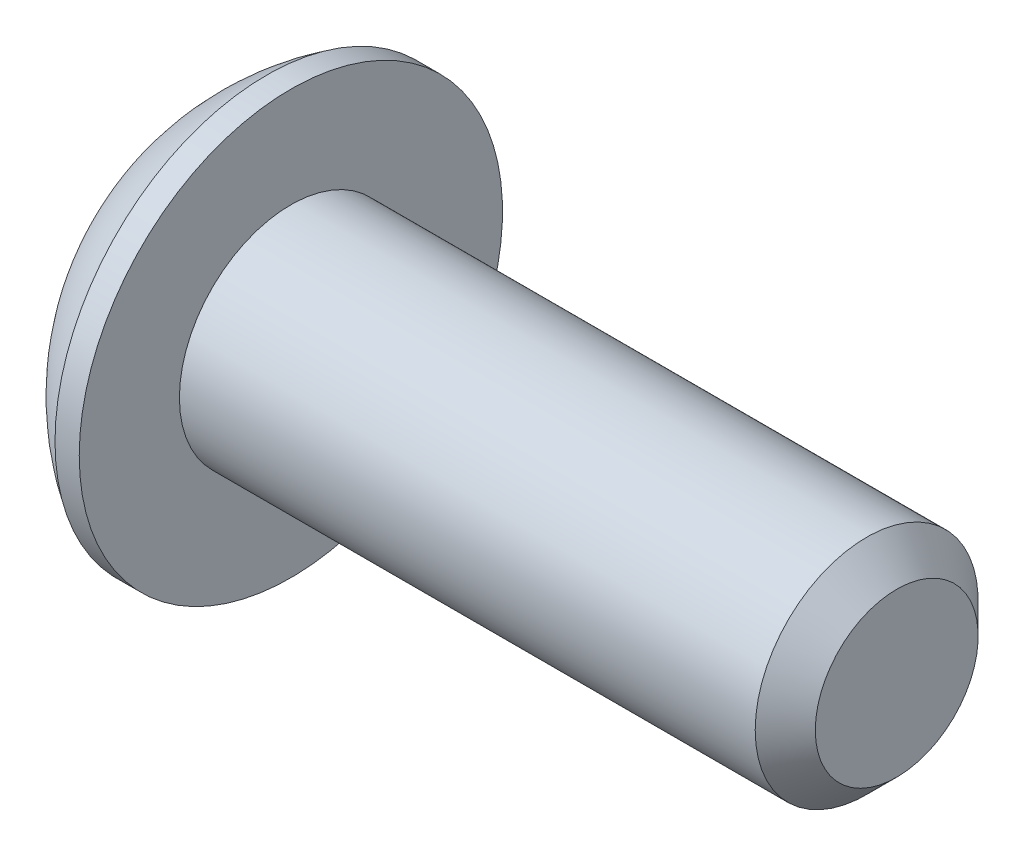
ISO-10303-21;
HEADER;
FILE_DESCRIPTION(('STEP AP214'),'2;1');
FILE_NAME('part.step','',(''),(''),'','','');
FILE_SCHEMA(('AUTOMOTIVE_DESIGN { 1 0 10303 214 1 1 1 1 }'));
ENDSEC;
DATA;
#1=APPLICATION_CONTEXT('core data for automotive mechanical design processes');
#2=APPLICATION_PROTOCOL_DEFINITION('international standard','automotive_design',2000,#1);
#3=PRODUCT_CONTEXT('',#1,'mechanical');
#4=PRODUCT('Part','Part','',(#3));
#5=PRODUCT_RELATED_PRODUCT_CATEGORY('part','',(#4));
#6=PRODUCT_DEFINITION_FORMATION('','',#4);
#7=PRODUCT_DEFINITION_CONTEXT('part definition',#1,'design');
#8=PRODUCT_DEFINITION('design','',#6,#7);
#9=PRODUCT_DEFINITION_SHAPE('','',#8);
#10=(LENGTH_UNIT() NAMED_UNIT(*) SI_UNIT(.MILLI.,.METRE.));
#11=(NAMED_UNIT(*) PLANE_ANGLE_UNIT() SI_UNIT($,.RADIAN.));
#12=(NAMED_UNIT(*) SI_UNIT($,.STERADIAN.) SOLID_ANGLE_UNIT());
#13=UNCERTAINTY_MEASURE_WITH_UNIT(LENGTH_MEASURE(1.E-05),#10,'distance_accuracy_value','');
#14=(GEOMETRIC_REPRESENTATION_CONTEXT(3) GLOBAL_UNCERTAINTY_ASSIGNED_CONTEXT((#13)) GLOBAL_UNIT_ASSIGNED_CONTEXT((#10,
#11,#12)) REPRESENTATION_CONTEXT('',''));
#15=CARTESIAN_POINT('',(0.,0.,0.));
#16=DIRECTION('',(0.,0.,1.));
#17=DIRECTION('',(1.,0.,0.));
#18=AXIS2_PLACEMENT_3D('',#15,#16,#17);
#19=CARTESIAN_POINT('',(0.,0.,0.));
#20=DIRECTION('',(-1.,0.,0.));
#21=DIRECTION('',(0.,0.,1.));
#22=AXIS2_PLACEMENT_3D('',#19,#20,#21);
#23=PLANE('',#22);
#24=CARTESIAN_POINT('',(0.,0.,0.));
#25=DIRECTION('',(-1.,0.,0.));
#26=DIRECTION('',(0.,0.,1.));
#27=AXIS2_PLACEMENT_3D('',#24,#25,#26);
#28=CIRCLE('',#27,1.6637);
#29=CARTESIAN_POINT('',(0.,0.,1.6637));
#30=VERTEX_POINT('',#29);
#31=EDGE_CURVE('E11',#30,#30,#28,.T.);
#32=ORIENTED_EDGE('',*,*,#31,.T.);
#33=EDGE_LOOP('',(#32));
#34=FACE_BOUND('',#33,.T.);
#35=DIRECTION('',(0.,-1.,0.));
#36=VECTOR('',#35,1.);
#37=CARTESIAN_POINT('',(0.,-0.571923176659243,0.9906));
#38=LINE('',#37,#36);
#39=CARTESIAN_POINT('',(0.,0.571923176659244,0.990600000000001));
#40=VERTEX_POINT('',#39);
#41=CARTESIAN_POINT('',(0.,-0.571923176659243,0.9906));
#42=VERTEX_POINT('',#41);
#43=EDGE_CURVE('E46',#40,#42,#38,.T.);
#44=ORIENTED_EDGE('',*,*,#43,.T.);
#45=DIRECTION('',(0.,-0.499999999999999,-0.866025403784439));
#46=VECTOR('',#45,1.);
#47=CARTESIAN_POINT('',(0.,-1.14384635331848,0.));
#48=LINE('',#47,#46);
#49=CARTESIAN_POINT('',(0.,-1.14384635331848,0.));
#50=VERTEX_POINT('',#49);
#51=EDGE_CURVE('E364',#42,#50,#48,.T.);
#52=ORIENTED_EDGE('',*,*,#51,.T.);
#53=DIRECTION('',(0.,0.499999999999999,-0.866025403784439));
#54=VECTOR('',#53,1.);
#55=CARTESIAN_POINT('',(0.,-0.571923176659242,-0.9906));
#56=LINE('',#55,#54);
#57=CARTESIAN_POINT('',(0.,-0.571923176659242,-0.9906));
#58=VERTEX_POINT('',#57);
#59=EDGE_CURVE('E126',#50,#58,#56,.T.);
#60=ORIENTED_EDGE('',*,*,#59,.T.);
#61=DIRECTION('',(0.,1.,0.));
#62=VECTOR('',#61,1.);
#63=CARTESIAN_POINT('',(0.,0.571923176659244,-0.9906));
#64=LINE('',#63,#62);
#65=CARTESIAN_POINT('',(0.,0.571923176659244,-0.9906));
#66=VERTEX_POINT('',#65);
#67=EDGE_CURVE('E367',#58,#66,#64,.T.);
#68=ORIENTED_EDGE('',*,*,#67,.T.);
#69=DIRECTION('',(0.,0.5,0.866025403784439));
#70=VECTOR('',#69,1.);
#71=CARTESIAN_POINT('',(0.,1.14384635331849,0.));
#72=LINE('',#71,#70);
#73=CARTESIAN_POINT('',(0.,1.14384635331849,0.));
#74=VERTEX_POINT('',#73);
#75=EDGE_CURVE('E369',#66,#74,#72,.T.);
#76=ORIENTED_EDGE('',*,*,#75,.T.);
#77=DIRECTION('',(0.,-0.5,0.866025403784439));
#78=VECTOR('',#77,1.);
#79=CARTESIAN_POINT('',(0.,0.571923176659244,0.990600000000001));
#80=LINE('',#79,#78);
#81=EDGE_CURVE('E371',#74,#40,#80,.T.);
#82=ORIENTED_EDGE('',*,*,#81,.T.);
#83=EDGE_LOOP('',(#44,#52,#60,#68,#76,#82));
#84=FACE_BOUND('',#83,.T.);
#85=ADVANCED_FACE('F32',(#34,#84),#23,.T.);
#86=CARTESIAN_POINT('',(3.55485043103449,0.,0.));
#87=DIRECTION('',(-1.,0.,0.));
#88=DIRECTION('',(0.,1.,0.));
#89=AXIS2_PLACEMENT_3D('',#86,#87,#88);
#90=SPHERICAL_SURFACE('',#89,3.92490245446);
#91=CARTESIAN_POINT('',(1.4732,0.,0.));
#92=DIRECTION('',(-1.,0.,0.));
#93=DIRECTION('',(0.,0.,1.));
#94=AXIS2_PLACEMENT_3D('',#91,#92,#93);
#95=CIRCLE('',#94,3.3274);
#96=CARTESIAN_POINT('',(1.4732,0.,3.3274));
#97=VERTEX_POINT('',#96);
#98=EDGE_CURVE('E39',#97,#97,#95,.T.);
#99=ORIENTED_EDGE('',*,*,#98,.T.);
#100=EDGE_LOOP('',(#99));
#101=FACE_BOUND('',#100,.T.);
#102=ORIENTED_EDGE('',*,*,#31,.F.);
#103=EDGE_LOOP('',(#102));
#104=FACE_BOUND('',#103,.T.);
#105=ADVANCED_FACE('F153',(#101,#104),#90,.T.);
#106=CARTESIAN_POINT('',(0.,0.,0.));
#107=DIRECTION('',(-1.,0.,0.));
#108=DIRECTION('',(0.,0.,1.));
#109=AXIS2_PLACEMENT_3D('',#106,#107,#108);
#110=CYLINDRICAL_SURFACE('',#109,3.3274);
#111=ORIENTED_EDGE('',*,*,#98,.F.);
#112=EDGE_LOOP('',(#111));
#113=FACE_BOUND('',#112,.T.);
#114=CARTESIAN_POINT('',(1.8542,0.,0.));
#115=DIRECTION('',(-1.,0.,0.));
#116=DIRECTION('',(0.,0.,1.));
#117=AXIS2_PLACEMENT_3D('',#114,#115,#116);
#118=CIRCLE('',#117,3.3274);
#119=CARTESIAN_POINT('',(1.8542,0.,3.3274));
#120=VERTEX_POINT('',#119);
#121=EDGE_CURVE('E148',#120,#120,#118,.T.);
#122=ORIENTED_EDGE('',*,*,#121,.T.);
#123=EDGE_LOOP('',(#122));
#124=FACE_BOUND('',#123,.T.);
#125=ADVANCED_FACE('F156',(#113,#124),#110,.T.);
#126=CARTESIAN_POINT('',(1.8542,1.7526,0.));
#127=DIRECTION('',(-1.,0.,0.));
#128=DIRECTION('',(0.,0.,1.));
#129=AXIS2_PLACEMENT_3D('',#126,#127,#128);
#130=PLANE('',#129);
#131=ORIENTED_EDGE('',*,*,#121,.F.);
#132=EDGE_LOOP('',(#131));
#133=FACE_BOUND('',#132,.T.);
#134=CARTESIAN_POINT('',(1.8542,0.,0.));
#135=DIRECTION('',(-1.,0.,0.));
#136=DIRECTION('',(0.,0.,1.));
#137=AXIS2_PLACEMENT_3D('',#134,#135,#136);
#138=CIRCLE('',#137,1.7526);
#139=CARTESIAN_POINT('',(1.8542,0.,1.7526));
#140=VERTEX_POINT('',#139);
#141=EDGE_CURVE('E145',#140,#140,#138,.T.);
#142=ORIENTED_EDGE('',*,*,#141,.T.);
#143=EDGE_LOOP('',(#142));
#144=FACE_BOUND('',#143,.T.);
#145=ADVANCED_FACE('F159',(#133,#144),#130,.F.);
#146=CARTESIAN_POINT('',(0.,0.,0.));
#147=DIRECTION('',(-1.,0.,0.));
#148=DIRECTION('',(0.,0.,1.));
#149=AXIS2_PLACEMENT_3D('',#146,#147,#148);
#150=CYLINDRICAL_SURFACE('',#149,1.7526);
#151=ORIENTED_EDGE('',*,*,#141,.F.);
#152=EDGE_LOOP('',(#151));
#153=FACE_BOUND('',#152,.T.);
#154=CARTESIAN_POINT('',(10.90676,0.,0.));
#155=DIRECTION('',(-1.,0.,0.));
#156=DIRECTION('',(0.,0.,1.));
#157=AXIS2_PLACEMENT_3D('',#154,#155,#156);
#158=CIRCLE('',#157,1.7526);
#159=CARTESIAN_POINT('',(10.90676,0.,1.7526));
#160=VERTEX_POINT('',#159);
#161=EDGE_CURVE('E142',#160,#160,#158,.T.);
#162=ORIENTED_EDGE('',*,*,#161,.T.);
#163=EDGE_LOOP('',(#162));
#164=FACE_BOUND('',#163,.T.);
#165=ADVANCED_FACE('F165',(#153,#164),#150,.T.);
#166=CARTESIAN_POINT('',(11.3792,0.,0.));
#167=DIRECTION('',(-1.,0.,0.));
#168=DIRECTION('',(0.,0.,1.));
#169=AXIS2_PLACEMENT_3D('',#166,#167,#168);
#170=CONICAL_SURFACE('',#169,1.28016,0.78539816339748);
#171=ORIENTED_EDGE('',*,*,#161,.F.);
#172=EDGE_LOOP('',(#171));
#173=FACE_BOUND('',#172,.T.);
#174=CARTESIAN_POINT('',(11.3792,0.,0.));
#175=DIRECTION('',(-1.,0.,0.));
#176=DIRECTION('',(0.,0.,1.));
#177=AXIS2_PLACEMENT_3D('',#174,#175,#176);
#178=CIRCLE('',#177,1.28016);
#179=CARTESIAN_POINT('',(11.3792,0.,1.28016));
#180=VERTEX_POINT('',#179);
#181=EDGE_CURVE('E138',#180,#180,#178,.T.);
#182=ORIENTED_EDGE('',*,*,#181,.T.);
#183=EDGE_LOOP('',(#182));
#184=FACE_BOUND('',#183,.T.);
#185=ADVANCED_FACE('F171',(#173,#184),#170,.T.);
#186=CARTESIAN_POINT('',(11.3792,0.,0.));
#187=DIRECTION('',(-1.,0.,0.));
#188=DIRECTION('',(0.,0.,1.));
#189=AXIS2_PLACEMENT_3D('',#186,#187,#188);
#190=PLANE('',#189);
#191=ORIENTED_EDGE('',*,*,#181,.F.);
#192=EDGE_LOOP('',(#191));
#193=FACE_BOUND('',#192,.T.);
#194=ADVANCED_FACE('F177',(#193),#190,.F.);
#195=CARTESIAN_POINT('',(1.1176,-1.14384635331848,0.));
#196=DIRECTION('',(0.,0.866025403784439,-0.499999999999999));
#197=DIRECTION('',(0.,0.499999999999999,0.866025403784439));
#198=AXIS2_PLACEMENT_3D('',#195,#196,#197);
#199=PLANE('',#198);
#200=DIRECTION('',(0.,-0.499999999999999,-0.866025403784439));
#201=VECTOR('',#200,1.);
#202=CARTESIAN_POINT('',(1.1176,-1.14384635331848,0.));
#203=LINE('',#202,#201);
#204=CARTESIAN_POINT('',(1.1176,-0.571923176659243,0.9906));
#205=VERTEX_POINT('',#204);
#206=CARTESIAN_POINT('',(1.1176,-0.857884764988864,0.495299999999998));
#207=VERTEX_POINT('',#206);
#208=EDGE_CURVE('E112',#205,#207,#203,.T.);
#209=ORIENTED_EDGE('',*,*,#208,.T.);
#210=CARTESIAN_POINT('',(1.1176,-1.14384635331848,0.));
#211=VERTEX_POINT('',#210);
#212=EDGE_CURVE('E107',#207,#211,#203,.T.);
#213=ORIENTED_EDGE('',*,*,#212,.T.);
#214=DIRECTION('',(-1.,0.,0.));
#215=VECTOR('',#214,1.);
#216=CARTESIAN_POINT('',(1.1176,-1.14384635331848,0.));
#217=LINE('',#216,#215);
#218=EDGE_CURVE('E109',#211,#50,#217,.T.);
#219=ORIENTED_EDGE('',*,*,#218,.T.);
#220=ORIENTED_EDGE('',*,*,#51,.F.);
#221=DIRECTION('',(-1.,0.,0.));
#222=VECTOR('',#221,1.);
#223=CARTESIAN_POINT('',(1.1176,-0.571923176659243,0.9906));
#224=LINE('',#223,#222);
#225=EDGE_CURVE('E359',#205,#42,#224,.T.);
#226=ORIENTED_EDGE('',*,*,#225,.F.);
#227=EDGE_LOOP('',(#209,#213,#219,#220,#226));
#228=FACE_BOUND('',#227,.T.);
#229=ADVANCED_FACE('F108',(#228),#199,.T.);
#230=CARTESIAN_POINT('',(1.1176,-0.571923176659242,-0.9906));
#231=DIRECTION('',(0.,0.866025403784439,0.499999999999999));
#232=DIRECTION('',(0.,-0.499999999999999,0.866025403784439));
#233=AXIS2_PLACEMENT_3D('',#230,#231,#232);
#234=PLANE('',#233);
#235=DIRECTION('',(0.,0.499999999999999,-0.866025403784439));
#236=VECTOR('',#235,1.);
#237=CARTESIAN_POINT('',(1.1176,-0.571923176659242,-0.9906));
#238=LINE('',#237,#236);
#239=CARTESIAN_POINT('',(1.1176,-0.857884764988865,-0.495299999999999));
#240=VERTEX_POINT('',#239);
#241=EDGE_CURVE('E54',#211,#240,#238,.T.);
#242=ORIENTED_EDGE('',*,*,#241,.T.);
#243=CARTESIAN_POINT('',(1.1176,-0.571923176659242,-0.9906));
#244=VERTEX_POINT('',#243);
#245=EDGE_CURVE('E121',#240,#244,#238,.T.);
#246=ORIENTED_EDGE('',*,*,#245,.T.);
#247=DIRECTION('',(-1.,0.,0.));
#248=VECTOR('',#247,1.);
#249=CARTESIAN_POINT('',(1.1176,-0.571923176659242,-0.9906));
#250=LINE('',#249,#248);
#251=EDGE_CURVE('E128',#244,#58,#250,.T.);
#252=ORIENTED_EDGE('',*,*,#251,.T.);
#253=ORIENTED_EDGE('',*,*,#59,.F.);
#254=ORIENTED_EDGE('',*,*,#218,.F.);
#255=EDGE_LOOP('',(#242,#246,#252,#253,#254));
#256=FACE_BOUND('',#255,.T.);
#257=ADVANCED_FACE('F124',(#256),#234,.T.);
#258=CARTESIAN_POINT('',(1.1176,0.571923176659244,-0.9906));
#259=DIRECTION('',(0.,0.,1.));
#260=DIRECTION('',(1.,0.,0.));
#261=AXIS2_PLACEMENT_3D('',#258,#259,#260);
#262=PLANE('',#261);
#263=DIRECTION('',(0.,1.,0.));
#264=VECTOR('',#263,1.);
#265=CARTESIAN_POINT('',(1.1176,0.571923176659244,-0.9906));
#266=LINE('',#265,#264);
#267=CARTESIAN_POINT('',(1.1176,0.,-0.9906));
#268=VERTEX_POINT('',#267);
#269=EDGE_CURVE('E389',#244,#268,#266,.T.);
#270=ORIENTED_EDGE('',*,*,#269,.T.);
#271=CARTESIAN_POINT('',(1.1176,0.571923176659244,-0.9906));
#272=VERTEX_POINT('',#271);
#273=EDGE_CURVE('E120',#268,#272,#266,.T.);
#274=ORIENTED_EDGE('',*,*,#273,.T.);
#275=DIRECTION('',(-1.,0.,0.));
#276=VECTOR('',#275,1.);
#277=CARTESIAN_POINT('',(1.1176,0.571923176659244,-0.9906));
#278=LINE('',#277,#276);
#279=EDGE_CURVE('E133',#272,#66,#278,.T.);
#280=ORIENTED_EDGE('',*,*,#279,.T.);
#281=ORIENTED_EDGE('',*,*,#67,.F.);
#282=ORIENTED_EDGE('',*,*,#251,.F.);
#283=EDGE_LOOP('',(#270,#274,#280,#281,#282));
#284=FACE_BOUND('',#283,.T.);
#285=ADVANCED_FACE('F238',(#284),#262,.T.);
#286=CARTESIAN_POINT('',(1.1176,1.14384635331849,0.));
#287=DIRECTION('',(0.,-0.866025403784439,0.5));
#288=DIRECTION('',(0.,-0.5,-0.866025403784439));
#289=AXIS2_PLACEMENT_3D('',#286,#287,#288);
#290=PLANE('',#289);
#291=DIRECTION('',(0.,0.5,0.866025403784439));
#292=VECTOR('',#291,1.);
#293=CARTESIAN_POINT('',(1.1176,1.14384635331849,0.));
#294=LINE('',#293,#292);
#295=CARTESIAN_POINT('',(1.1176,0.857884764988866,-0.495300000000001));
#296=VERTEX_POINT('',#295);
#297=EDGE_CURVE('E393',#272,#296,#294,.T.);
#298=ORIENTED_EDGE('',*,*,#297,.T.);
#299=CARTESIAN_POINT('',(1.1176,1.14384635331849,0.));
#300=VERTEX_POINT('',#299);
#301=EDGE_CURVE('E391',#296,#300,#294,.T.);
#302=ORIENTED_EDGE('',*,*,#301,.T.);
#303=DIRECTION('',(-1.,0.,0.));
#304=VECTOR('',#303,1.);
#305=CARTESIAN_POINT('',(1.1176,1.14384635331849,0.));
#306=LINE('',#305,#304);
#307=EDGE_CURVE('E375',#300,#74,#306,.T.);
#308=ORIENTED_EDGE('',*,*,#307,.T.);
#309=ORIENTED_EDGE('',*,*,#75,.F.);
#310=ORIENTED_EDGE('',*,*,#279,.F.);
#311=EDGE_LOOP('',(#298,#302,#308,#309,#310));
#312=FACE_BOUND('',#311,.T.);
#313=ADVANCED_FACE('F247',(#312),#290,.T.);
#314=CARTESIAN_POINT('',(1.1176,0.571923176659244,0.990600000000001));
#315=DIRECTION('',(0.,-0.866025403784439,-0.5));
#316=DIRECTION('',(0.,0.5,-0.866025403784439));
#317=AXIS2_PLACEMENT_3D('',#314,#315,#316);
#318=PLANE('',#317);
#319=DIRECTION('',(0.,-0.5,0.866025403784439));
#320=VECTOR('',#319,1.);
#321=CARTESIAN_POINT('',(1.1176,0.571923176659244,0.990600000000001));
#322=LINE('',#321,#320);
#323=CARTESIAN_POINT('',(1.1176,0.857884764988866,0.495300000000001));
#324=VERTEX_POINT('',#323);
#325=EDGE_CURVE('E354',#300,#324,#322,.T.);
#326=ORIENTED_EDGE('',*,*,#325,.T.);
#327=CARTESIAN_POINT('',(1.1176,0.571923176659244,0.990600000000001));
#328=VERTEX_POINT('',#327);
#329=EDGE_CURVE('E350',#324,#328,#322,.T.);
#330=ORIENTED_EDGE('',*,*,#329,.T.);
#331=DIRECTION('',(-1.,0.,0.));
#332=VECTOR('',#331,1.);
#333=CARTESIAN_POINT('',(1.1176,0.571923176659244,0.990600000000001));
#334=LINE('',#333,#332);
#335=EDGE_CURVE('E358',#328,#40,#334,.T.);
#336=ORIENTED_EDGE('',*,*,#335,.T.);
#337=ORIENTED_EDGE('',*,*,#81,.F.);
#338=ORIENTED_EDGE('',*,*,#307,.F.);
#339=EDGE_LOOP('',(#326,#330,#336,#337,#338));
#340=FACE_BOUND('',#339,.T.);
#341=ADVANCED_FACE('F257',(#340),#318,.T.);
#342=CARTESIAN_POINT('',(1.1176,-0.571923176659243,0.9906));
#343=DIRECTION('',(0.,0.,-1.));
#344=DIRECTION('',(0.,1.,0.));
#345=AXIS2_PLACEMENT_3D('',#342,#343,#344);
#346=PLANE('',#345);
#347=DIRECTION('',(0.,-1.,0.));
#348=VECTOR('',#347,1.);
#349=CARTESIAN_POINT('',(1.1176,-0.571923176659243,0.9906));
#350=LINE('',#349,#348);
#351=CARTESIAN_POINT('',(1.1176,0.,0.9906));
#352=VERTEX_POINT('',#351);
#353=EDGE_CURVE('E349',#328,#352,#350,.T.);
#354=ORIENTED_EDGE('',*,*,#353,.T.);
#355=EDGE_CURVE('E352',#352,#205,#350,.T.);
#356=ORIENTED_EDGE('',*,*,#355,.T.);
#357=ORIENTED_EDGE('',*,*,#225,.T.);
#358=ORIENTED_EDGE('',*,*,#43,.F.);
#359=ORIENTED_EDGE('',*,*,#335,.F.);
#360=EDGE_LOOP('',(#354,#356,#357,#358,#359));
#361=FACE_BOUND('',#360,.T.);
#362=ADVANCED_FACE('F267',(#361),#346,.T.);
#363=CARTESIAN_POINT('',(1.1176,-1.71576952997773,-0.9906));
#364=DIRECTION('',(1.,0.,0.));
#365=DIRECTION('',(0.,0.,-1.));
#366=AXIS2_PLACEMENT_3D('',#363,#364,#365);
#367=PLANE('',#366);
#368=CARTESIAN_POINT('',(1.1176,0.,0.));
#369=DIRECTION('',(-1.,0.,0.));
#370=DIRECTION('',(0.,0.,1.));
#371=AXIS2_PLACEMENT_3D('',#368,#369,#370);
#372=CIRCLE('',#371,0.9906);
#373=EDGE_CURVE('E396',#296,#268,#372,.T.);
#374=ORIENTED_EDGE('',*,*,#373,.F.);
#375=ORIENTED_EDGE('',*,*,#297,.F.);
#376=ORIENTED_EDGE('',*,*,#273,.F.);
#377=EDGE_LOOP('',(#374,#375,#376));
#378=FACE_BOUND('',#377,.T.);
#379=ADVANCED_FACE('F277',(#378),#367,.F.);
#380=EDGE_CURVE('E139',#324,#296,#372,.T.);
#381=ORIENTED_EDGE('',*,*,#380,.F.);
#382=ORIENTED_EDGE('',*,*,#325,.F.);
#383=ORIENTED_EDGE('',*,*,#301,.F.);
#384=EDGE_LOOP('',(#381,#382,#383));
#385=FACE_BOUND('',#384,.T.);
#386=ADVANCED_FACE('F287',(#385),#367,.F.);
#387=EDGE_CURVE('E132',#352,#324,#372,.T.);
#388=ORIENTED_EDGE('',*,*,#387,.F.);
#389=ORIENTED_EDGE('',*,*,#353,.F.);
#390=ORIENTED_EDGE('',*,*,#329,.F.);
#391=EDGE_LOOP('',(#388,#389,#390));
#392=FACE_BOUND('',#391,.T.);
#393=ADVANCED_FACE('F298',(#392),#367,.F.);
#394=EDGE_CURVE('E127',#207,#352,#372,.T.);
#395=ORIENTED_EDGE('',*,*,#394,.F.);
#396=ORIENTED_EDGE('',*,*,#208,.F.);
#397=ORIENTED_EDGE('',*,*,#355,.F.);
#398=EDGE_LOOP('',(#395,#396,#397));
#399=FACE_BOUND('',#398,.T.);
#400=ADVANCED_FACE('F307',(#399),#367,.F.);
#401=EDGE_CURVE('E118',#240,#207,#372,.T.);
#402=ORIENTED_EDGE('',*,*,#401,.F.);
#403=ORIENTED_EDGE('',*,*,#241,.F.);
#404=ORIENTED_EDGE('',*,*,#212,.F.);
#405=EDGE_LOOP('',(#402,#403,#404));
#406=FACE_BOUND('',#405,.T.);
#407=ADVANCED_FACE('F117',(#406),#367,.F.);
#408=EDGE_CURVE('E390',#268,#240,#372,.T.);
#409=ORIENTED_EDGE('',*,*,#408,.F.);
#410=ORIENTED_EDGE('',*,*,#269,.F.);
#411=ORIENTED_EDGE('',*,*,#245,.F.);
#412=EDGE_LOOP('',(#409,#410,#411));
#413=FACE_BOUND('',#412,.T.);
#414=ADVANCED_FACE('F290',(#413),#367,.F.);
#415=CARTESIAN_POINT('',(1.68952317665925,0.,0.));
#416=DIRECTION('',(-1.,0.,0.));
#417=DIRECTION('',(0.,0.,1.));
#418=AXIS2_PLACEMENT_3D('',#415,#416,#417);
#419=CONICAL_SURFACE('',#418,0.,1.04719755119659);
#420=ORIENTED_EDGE('',*,*,#387,.T.);
#421=ORIENTED_EDGE('',*,*,#380,.T.);
#422=ORIENTED_EDGE('',*,*,#373,.T.);
#423=ORIENTED_EDGE('',*,*,#408,.T.);
#424=ORIENTED_EDGE('',*,*,#401,.T.);
#425=ORIENTED_EDGE('',*,*,#394,.T.);
#426=EDGE_LOOP('',(#420,#421,#422,#423,#424,#425));
#427=FACE_BOUND('',#426,.T.);
#428=CARTESIAN_POINT('',(1.68952317665925,0.,0.));
#429=VERTEX_POINT('',#428);
#430=VERTEX_LOOP('',#429);
#431=FACE_BOUND('',#430,.T.);
#432=ADVANCED_FACE('F331',(#427,#431),#419,.F.);
#433=CLOSED_SHELL('',(#85,#105,#125,#145,#165,#185,#194,#229,#257,#285,#313,#341,#362,#379,#386,
#393,#400,#407,#414,#432));
#434=MANIFOLD_SOLID_BREP('B2',#433);
#435=ADVANCED_BREP_SHAPE_REPRESENTATION('',(#18,#434),#14);
#436=SHAPE_DEFINITION_REPRESENTATION(#9,#435);
ENDSEC;
END-ISO-10303-21;
